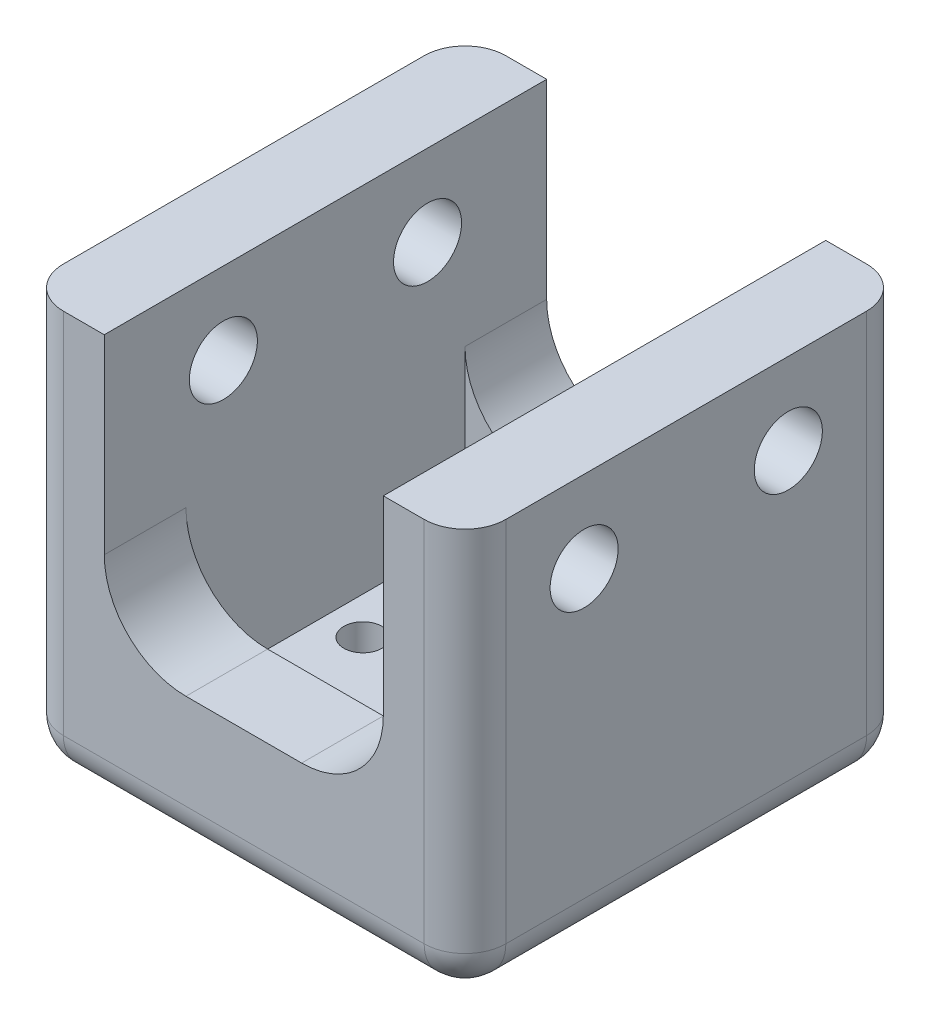
ISO-10303-21;
HEADER;
FILE_DESCRIPTION(('STEP AP214'),'2;1');
FILE_NAME('part.step','',(''),(''),'','','');
FILE_SCHEMA(('AUTOMOTIVE_DESIGN { 1 0 10303 214 1 1 1 1 }'));
ENDSEC;
DATA;
#1=APPLICATION_CONTEXT('core data for automotive mechanical design processes');
#2=APPLICATION_PROTOCOL_DEFINITION('international standard','automotive_design',2000,#1);
#3=PRODUCT_CONTEXT('',#1,'mechanical');
#4=PRODUCT('Part','Part','',(#3));
#5=PRODUCT_RELATED_PRODUCT_CATEGORY('part','',(#4));
#6=PRODUCT_DEFINITION_FORMATION('','',#4);
#7=PRODUCT_DEFINITION_CONTEXT('part definition',#1,'design');
#8=PRODUCT_DEFINITION('design','',#6,#7);
#9=PRODUCT_DEFINITION_SHAPE('','',#8);
#10=(LENGTH_UNIT() NAMED_UNIT(*) SI_UNIT(.MILLI.,.METRE.));
#11=(NAMED_UNIT(*) PLANE_ANGLE_UNIT() SI_UNIT($,.RADIAN.));
#12=(NAMED_UNIT(*) SI_UNIT($,.STERADIAN.) SOLID_ANGLE_UNIT());
#13=UNCERTAINTY_MEASURE_WITH_UNIT(LENGTH_MEASURE(1.E-05),#10,'distance_accuracy_value','');
#14=(GEOMETRIC_REPRESENTATION_CONTEXT(3) GLOBAL_UNCERTAINTY_ASSIGNED_CONTEXT((#13)) GLOBAL_UNIT_ASSIGNED_CONTEXT((#10,
#11,#12)) REPRESENTATION_CONTEXT('',''));
#15=CARTESIAN_POINT('',(0.,0.,0.));
#16=DIRECTION('',(0.,0.,1.));
#17=DIRECTION('',(1.,0.,0.));
#18=AXIS2_PLACEMENT_3D('',#15,#16,#17);
#19=CARTESIAN_POINT('',(0.,38.1,0.));
#20=DIRECTION('',(0.,-1.,0.));
#21=DIRECTION('',(0.,0.,-1.));
#22=AXIS2_PLACEMENT_3D('',#19,#20,#21);
#23=PLANE('',#22);
#24=DIRECTION('',(1.,0.,0.));
#25=VECTOR('',#24,1.);
#26=CARTESIAN_POINT('',(-20.6375,38.1,-20.6375));
#27=LINE('',#26,#25);
#28=CARTESIAN_POINT('',(-16.8275,38.1,-20.6375));
#29=VERTEX_POINT('',#28);
#30=CARTESIAN_POINT('',(-13.0175,38.1,-20.6375));
#31=VERTEX_POINT('',#30);
#32=EDGE_CURVE('E276',#29,#31,#27,.T.);
#33=ORIENTED_EDGE('',*,*,#32,.F.);
#34=CARTESIAN_POINT('',(-16.8275,38.1,-16.8275));
#35=DIRECTION('',(0.,-1.,0.));
#36=DIRECTION('',(0.,0.,-1.));
#37=AXIS2_PLACEMENT_3D('',#34,#35,#36);
#38=CIRCLE('',#37,3.81);
#39=CARTESIAN_POINT('',(-20.6375,38.1,-16.8275));
#40=VERTEX_POINT('',#39);
#41=EDGE_CURVE('E346',#29,#40,#38,.F.);
#42=ORIENTED_EDGE('',*,*,#41,.T.);
#43=DIRECTION('',(0.,0.,-1.));
#44=VECTOR('',#43,1.);
#45=CARTESIAN_POINT('',(-20.6375,38.1,-20.6375));
#46=LINE('',#45,#44);
#47=CARTESIAN_POINT('',(-20.6375,38.1,16.8275));
#48=VERTEX_POINT('',#47);
#49=EDGE_CURVE('E284',#48,#40,#46,.T.);
#50=ORIENTED_EDGE('',*,*,#49,.F.);
#51=CARTESIAN_POINT('',(-16.8275,38.1,16.8275));
#52=DIRECTION('',(0.,-1.,0.));
#53=DIRECTION('',(0.,0.,-1.));
#54=AXIS2_PLACEMENT_3D('',#51,#52,#53);
#55=CIRCLE('',#54,3.81);
#56=CARTESIAN_POINT('',(-16.8275,38.1,20.6375));
#57=VERTEX_POINT('',#56);
#58=EDGE_CURVE('E344',#48,#57,#55,.F.);
#59=ORIENTED_EDGE('',*,*,#58,.T.);
#60=DIRECTION('',(-1.,0.,0.));
#61=VECTOR('',#60,1.);
#62=CARTESIAN_POINT('',(-20.6375,38.1,20.6375));
#63=LINE('',#62,#61);
#64=CARTESIAN_POINT('',(-13.0175,38.1,20.6375));
#65=VERTEX_POINT('',#64);
#66=EDGE_CURVE('E281',#65,#57,#63,.T.);
#67=ORIENTED_EDGE('',*,*,#66,.F.);
#68=DIRECTION('',(0.,0.,-1.));
#69=VECTOR('',#68,1.);
#70=CARTESIAN_POINT('',(-13.0175,38.1,-13.0175));
#71=LINE('',#70,#69);
#72=EDGE_CURVE('E261',#65,#31,#71,.T.);
#73=ORIENTED_EDGE('',*,*,#72,.T.);
#74=EDGE_LOOP('',(#33,#42,#50,#59,#67,#73));
#75=FACE_BOUND('',#74,.T.);
#76=ADVANCED_FACE('F35',(#75),#23,.F.);
#77=CARTESIAN_POINT('',(0.,5.08,0.));
#78=DIRECTION('',(0.,-1.,0.));
#79=DIRECTION('',(0.,0.,-1.));
#80=AXIS2_PLACEMENT_3D('',#77,#78,#79);
#81=PLANE('',#80);
#82=DIRECTION('',(0.,0.,1.));
#83=VECTOR('',#82,1.);
#84=CARTESIAN_POINT('',(-13.0175,5.08,13.0175));
#85=LINE('',#84,#83);
#86=CARTESIAN_POINT('',(-13.0175,5.08,-13.0175));
#87=VERTEX_POINT('',#86);
#88=CARTESIAN_POINT('',(-13.0175,5.08000000000002,13.0175));
#89=VERTEX_POINT('',#88);
#90=EDGE_CURVE('E309',#87,#89,#85,.T.);
#91=ORIENTED_EDGE('',*,*,#90,.T.);
#92=DIRECTION('',(1.,0.,0.));
#93=VECTOR('',#92,1.);
#94=CARTESIAN_POINT('',(-13.0175,5.08,13.0175));
#95=LINE('',#94,#93);
#96=CARTESIAN_POINT('',(13.0175,5.08000000000002,13.0175));
#97=VERTEX_POINT('',#96);
#98=EDGE_CURVE('E314',#89,#97,#95,.T.);
#99=ORIENTED_EDGE('',*,*,#98,.T.);
#100=DIRECTION('',(0.,0.,-1.));
#101=VECTOR('',#100,1.);
#102=CARTESIAN_POINT('',(13.0175,5.08,13.0175));
#103=LINE('',#102,#101);
#104=CARTESIAN_POINT('',(13.0175,5.08000000000002,-13.0175));
#105=VERTEX_POINT('',#104);
#106=EDGE_CURVE('E317',#97,#105,#103,.T.);
#107=ORIENTED_EDGE('',*,*,#106,.T.);
#108=DIRECTION('',(-1.,0.,0.));
#109=VECTOR('',#108,1.);
#110=CARTESIAN_POINT('',(-13.0175,5.08,-13.0175));
#111=LINE('',#110,#109);
#112=EDGE_CURVE('E320',#105,#87,#111,.T.);
#113=ORIENTED_EDGE('',*,*,#112,.T.);
#114=EDGE_LOOP('',(#91,#99,#107,#113));
#115=FACE_BOUND('',#114,.T.);
#116=CARTESIAN_POINT('',(0.,5.08,-9.525));
#117=DIRECTION('',(0.,1.,0.));
#118=DIRECTION('',(0.,0.,1.));
#119=AXIS2_PLACEMENT_3D('',#116,#117,#118);
#120=CIRCLE('',#119,1.778);
#121=CARTESIAN_POINT('',(0.,5.08,-7.747));
#122=VERTEX_POINT('',#121);
#123=EDGE_CURVE('E306',#122,#122,#120,.T.);
#124=ORIENTED_EDGE('',*,*,#123,.F.);
#125=EDGE_LOOP('',(#124));
#126=FACE_BOUND('',#125,.T.);
#127=CARTESIAN_POINT('',(-9.525,5.08,0.));
#128=DIRECTION('',(0.,1.,0.));
#129=DIRECTION('',(0.,0.,1.));
#130=AXIS2_PLACEMENT_3D('',#127,#128,#129);
#131=CIRCLE('',#130,1.778);
#132=CARTESIAN_POINT('',(-9.525,5.08,1.778));
#133=VERTEX_POINT('',#132);
#134=EDGE_CURVE('E300',#133,#133,#131,.T.);
#135=ORIENTED_EDGE('',*,*,#134,.F.);
#136=EDGE_LOOP('',(#135));
#137=FACE_BOUND('',#136,.T.);
#138=CARTESIAN_POINT('',(9.525,5.08,0.));
#139=DIRECTION('',(0.,1.,0.));
#140=DIRECTION('',(0.,0.,1.));
#141=AXIS2_PLACEMENT_3D('',#138,#139,#140);
#142=CIRCLE('',#141,1.778);
#143=CARTESIAN_POINT('',(9.525,5.08,1.778));
#144=VERTEX_POINT('',#143);
#145=EDGE_CURVE('E294',#144,#144,#142,.T.);
#146=ORIENTED_EDGE('',*,*,#145,.F.);
#147=EDGE_LOOP('',(#146));
#148=FACE_BOUND('',#147,.T.);
#149=CARTESIAN_POINT('',(0.,5.08,9.525));
#150=DIRECTION('',(0.,1.,0.));
#151=DIRECTION('',(0.,0.,1.));
#152=AXIS2_PLACEMENT_3D('',#149,#150,#151);
#153=CIRCLE('',#152,1.778);
#154=CARTESIAN_POINT('',(0.,5.08,11.303));
#155=VERTEX_POINT('',#154);
#156=EDGE_CURVE('E288',#155,#155,#153,.T.);
#157=ORIENTED_EDGE('',*,*,#156,.F.);
#158=EDGE_LOOP('',(#157));
#159=FACE_BOUND('',#158,.T.);
#160=ADVANCED_FACE('F442',(#115,#126,#137,#148,#159),#81,.F.);
#161=CARTESIAN_POINT('',(0.,0.,0.));
#162=DIRECTION('',(0.,-1.,0.));
#163=DIRECTION('',(0.,0.,-1.));
#164=AXIS2_PLACEMENT_3D('',#161,#162,#163);
#165=PLANE('',#164);
#166=DIRECTION('',(1.,0.,0.));
#167=VECTOR('',#166,1.);
#168=CARTESIAN_POINT('',(0.,0.,-16.8275));
#169=LINE('',#168,#167);
#170=CARTESIAN_POINT('',(-16.8275,0.,-16.8275));
#171=VERTEX_POINT('',#170);
#172=CARTESIAN_POINT('',(16.8275,0.,-16.8275));
#173=VERTEX_POINT('',#172);
#174=EDGE_CURVE('E355',#171,#173,#169,.T.);
#175=ORIENTED_EDGE('',*,*,#174,.T.);
#176=DIRECTION('',(0.,0.,1.));
#177=VECTOR('',#176,1.);
#178=CARTESIAN_POINT('',(16.8275,0.,0.));
#179=LINE('',#178,#177);
#180=CARTESIAN_POINT('',(16.8275,0.,16.8275));
#181=VERTEX_POINT('',#180);
#182=EDGE_CURVE('E357',#173,#181,#179,.T.);
#183=ORIENTED_EDGE('',*,*,#182,.T.);
#184=DIRECTION('',(-1.,0.,0.));
#185=VECTOR('',#184,1.);
#186=CARTESIAN_POINT('',(0.,0.,16.8275));
#187=LINE('',#186,#185);
#188=CARTESIAN_POINT('',(-16.8275,0.,16.8275));
#189=VERTEX_POINT('',#188);
#190=EDGE_CURVE('E351',#181,#189,#187,.T.);
#191=ORIENTED_EDGE('',*,*,#190,.T.);
#192=DIRECTION('',(0.,0.,-1.));
#193=VECTOR('',#192,1.);
#194=CARTESIAN_POINT('',(-16.8275,0.,0.));
#195=LINE('',#194,#193);
#196=EDGE_CURVE('E353',#189,#171,#195,.T.);
#197=ORIENTED_EDGE('',*,*,#196,.T.);
#198=EDGE_LOOP('',(#175,#183,#191,#197));
#199=FACE_BOUND('',#198,.T.);
#200=CARTESIAN_POINT('',(9.525,0.,0.));
#201=DIRECTION('',(0.,1.,0.));
#202=DIRECTION('',(0.,0.,1.));
#203=AXIS2_PLACEMENT_3D('',#200,#201,#202);
#204=CIRCLE('',#203,1.778);
#205=CARTESIAN_POINT('',(9.525,0.,1.778));
#206=VERTEX_POINT('',#205);
#207=EDGE_CURVE('E291',#206,#206,#204,.T.);
#208=ORIENTED_EDGE('',*,*,#207,.T.);
#209=EDGE_LOOP('',(#208));
#210=FACE_BOUND('',#209,.T.);
#211=CARTESIAN_POINT('',(0.,0.,-9.525));
#212=DIRECTION('',(0.,1.,0.));
#213=DIRECTION('',(0.,0.,1.));
#214=AXIS2_PLACEMENT_3D('',#211,#212,#213);
#215=CIRCLE('',#214,1.778);
#216=CARTESIAN_POINT('',(0.,0.,-7.747));
#217=VERTEX_POINT('',#216);
#218=EDGE_CURVE('E303',#217,#217,#215,.T.);
#219=ORIENTED_EDGE('',*,*,#218,.T.);
#220=EDGE_LOOP('',(#219));
#221=FACE_BOUND('',#220,.T.);
#222=CARTESIAN_POINT('',(-9.525,0.,0.));
#223=DIRECTION('',(0.,1.,0.));
#224=DIRECTION('',(0.,0.,1.));
#225=AXIS2_PLACEMENT_3D('',#222,#223,#224);
#226=CIRCLE('',#225,1.778);
#227=CARTESIAN_POINT('',(-9.525,0.,1.778));
#228=VERTEX_POINT('',#227);
#229=EDGE_CURVE('E297',#228,#228,#226,.T.);
#230=ORIENTED_EDGE('',*,*,#229,.T.);
#231=EDGE_LOOP('',(#230));
#232=FACE_BOUND('',#231,.T.);
#233=CARTESIAN_POINT('',(0.,0.,9.525));
#234=DIRECTION('',(0.,1.,0.));
#235=DIRECTION('',(0.,0.,1.));
#236=AXIS2_PLACEMENT_3D('',#233,#234,#235);
#237=CIRCLE('',#236,1.778);
#238=CARTESIAN_POINT('',(0.,0.,11.303));
#239=VERTEX_POINT('',#238);
#240=EDGE_CURVE('E287',#239,#239,#237,.T.);
#241=ORIENTED_EDGE('',*,*,#240,.T.);
#242=EDGE_LOOP('',(#241));
#243=FACE_BOUND('',#242,.T.);
#244=ADVANCED_FACE('F449',(#199,#210,#221,#232,#243),#165,.T.);
#245=CARTESIAN_POINT('',(0.,5.08,-9.525));
#246=DIRECTION('',(0.,-1.,0.));
#247=DIRECTION('',(0.,0.,-1.));
#248=AXIS2_PLACEMENT_3D('',#245,#246,#247);
#249=CYLINDRICAL_SURFACE('',#248,1.778);
#250=ORIENTED_EDGE('',*,*,#123,.T.);
#251=EDGE_LOOP('',(#250));
#252=FACE_BOUND('',#251,.T.);
#253=ORIENTED_EDGE('',*,*,#218,.F.);
#254=EDGE_LOOP('',(#253));
#255=FACE_BOUND('',#254,.T.);
#256=ADVANCED_FACE('F590',(#252,#255),#249,.F.);
#257=CARTESIAN_POINT('',(-9.525,5.08,0.));
#258=DIRECTION('',(0.,-1.,0.));
#259=DIRECTION('',(0.,0.,-1.));
#260=AXIS2_PLACEMENT_3D('',#257,#258,#259);
#261=CYLINDRICAL_SURFACE('',#260,1.778);
#262=ORIENTED_EDGE('',*,*,#134,.T.);
#263=EDGE_LOOP('',(#262));
#264=FACE_BOUND('',#263,.T.);
#265=ORIENTED_EDGE('',*,*,#229,.F.);
#266=EDGE_LOOP('',(#265));
#267=FACE_BOUND('',#266,.T.);
#268=ADVANCED_FACE('F595',(#264,#267),#261,.F.);
#269=CARTESIAN_POINT('',(9.525,5.08,0.));
#270=DIRECTION('',(0.,-1.,0.));
#271=DIRECTION('',(0.,0.,-1.));
#272=AXIS2_PLACEMENT_3D('',#269,#270,#271);
#273=CYLINDRICAL_SURFACE('',#272,1.778);
#274=ORIENTED_EDGE('',*,*,#145,.T.);
#275=EDGE_LOOP('',(#274));
#276=FACE_BOUND('',#275,.T.);
#277=ORIENTED_EDGE('',*,*,#207,.F.);
#278=EDGE_LOOP('',(#277));
#279=FACE_BOUND('',#278,.T.);
#280=ADVANCED_FACE('F585',(#276,#279),#273,.F.);
#281=CARTESIAN_POINT('',(0.,5.08,9.525));
#282=DIRECTION('',(0.,-1.,0.));
#283=DIRECTION('',(0.,0.,-1.));
#284=AXIS2_PLACEMENT_3D('',#281,#282,#283);
#285=CYLINDRICAL_SURFACE('',#284,1.778);
#286=ORIENTED_EDGE('',*,*,#156,.T.);
#287=EDGE_LOOP('',(#286));
#288=FACE_BOUND('',#287,.T.);
#289=ORIENTED_EDGE('',*,*,#240,.F.);
#290=EDGE_LOOP('',(#289));
#291=FACE_BOUND('',#290,.T.);
#292=ADVANCED_FACE('F582',(#288,#291),#285,.F.);
#293=CARTESIAN_POINT('',(-13.0175,38.1,13.0175));
#294=DIRECTION('',(0.,0.,1.));
#295=DIRECTION('',(1.,0.,0.));
#296=AXIS2_PLACEMENT_3D('',#293,#294,#295);
#297=PLANE('',#296);
#298=DIRECTION('',(0.,-1.,0.));
#299=VECTOR('',#298,1.);
#300=CARTESIAN_POINT('',(-13.0175,38.1,13.0175));
#301=LINE('',#300,#299);
#302=CARTESIAN_POINT('',(-13.0175,20.32,13.0175));
#303=VERTEX_POINT('',#302);
#304=EDGE_CURVE('E268',#303,#89,#301,.T.);
#305=ORIENTED_EDGE('',*,*,#304,.F.);
#306=CARTESIAN_POINT('',(-5.3975,20.32,13.0175));
#307=DIRECTION('',(0.,0.,1.));
#308=DIRECTION('',(1.,0.,0.));
#309=AXIS2_PLACEMENT_3D('',#306,#307,#308);
#310=CIRCLE('',#309,7.62);
#311=CARTESIAN_POINT('',(-5.3975,12.7,13.0175));
#312=VERTEX_POINT('',#311);
#313=EDGE_CURVE('E258',#303,#312,#310,.T.);
#314=ORIENTED_EDGE('',*,*,#313,.T.);
#315=DIRECTION('',(1.,0.,0.));
#316=VECTOR('',#315,1.);
#317=CARTESIAN_POINT('',(-13.0175,12.7,13.0175));
#318=LINE('',#317,#316);
#319=CARTESIAN_POINT('',(5.3975,12.7,13.0175));
#320=VERTEX_POINT('',#319);
#321=EDGE_CURVE('E248',#312,#320,#318,.T.);
#322=ORIENTED_EDGE('',*,*,#321,.T.);
#323=CARTESIAN_POINT('',(5.3975,20.32,13.0175));
#324=DIRECTION('',(0.,0.,1.));
#325=DIRECTION('',(1.,0.,0.));
#326=AXIS2_PLACEMENT_3D('',#323,#324,#325);
#327=CIRCLE('',#326,7.62);
#328=CARTESIAN_POINT('',(13.0175,20.32,13.0175));
#329=VERTEX_POINT('',#328);
#330=EDGE_CURVE('E254',#320,#329,#327,.T.);
#331=ORIENTED_EDGE('',*,*,#330,.T.);
#332=DIRECTION('',(0.,-1.,0.));
#333=VECTOR('',#332,1.);
#334=CARTESIAN_POINT('',(13.0175,38.1,13.0175));
#335=LINE('',#334,#333);
#336=EDGE_CURVE('E271',#329,#97,#335,.T.);
#337=ORIENTED_EDGE('',*,*,#336,.T.);
#338=ORIENTED_EDGE('',*,*,#98,.F.);
#339=EDGE_LOOP('',(#305,#314,#322,#331,#337,#338));
#340=FACE_BOUND('',#339,.T.);
#341=ADVANCED_FACE('F571',(#340),#297,.F.);
#342=CARTESIAN_POINT('',(-13.0175,38.1,-13.0175));
#343=DIRECTION('',(0.,0.,-1.));
#344=DIRECTION('',(-1.,0.,0.));
#345=AXIS2_PLACEMENT_3D('',#342,#343,#344);
#346=PLANE('',#345);
#347=DIRECTION('',(-1.,0.,0.));
#348=VECTOR('',#347,1.);
#349=CARTESIAN_POINT('',(-13.0175,12.7,-13.0175));
#350=LINE('',#349,#348);
#351=CARTESIAN_POINT('',(5.3975,12.7,-13.0175));
#352=VERTEX_POINT('',#351);
#353=CARTESIAN_POINT('',(-5.3975,12.7,-13.0175));
#354=VERTEX_POINT('',#353);
#355=EDGE_CURVE('E240',#352,#354,#350,.T.);
#356=ORIENTED_EDGE('',*,*,#355,.T.);
#357=CARTESIAN_POINT('',(-5.3975,20.32,-13.0175));
#358=DIRECTION('',(0.,0.,-1.));
#359=DIRECTION('',(-1.,0.,0.));
#360=AXIS2_PLACEMENT_3D('',#357,#358,#359);
#361=CIRCLE('',#360,7.62);
#362=CARTESIAN_POINT('',(-13.0175,20.32,-13.0175));
#363=VERTEX_POINT('',#362);
#364=EDGE_CURVE('E193',#354,#363,#361,.T.);
#365=ORIENTED_EDGE('',*,*,#364,.T.);
#366=DIRECTION('',(0.,-1.,0.));
#367=VECTOR('',#366,1.);
#368=CARTESIAN_POINT('',(-13.0175,38.1,-13.0175));
#369=LINE('',#368,#367);
#370=EDGE_CURVE('E267',#363,#87,#369,.T.);
#371=ORIENTED_EDGE('',*,*,#370,.T.);
#372=ORIENTED_EDGE('',*,*,#112,.F.);
#373=DIRECTION('',(0.,-1.,0.));
#374=VECTOR('',#373,1.);
#375=CARTESIAN_POINT('',(13.0175,38.1,-13.0175));
#376=LINE('',#375,#374);
#377=CARTESIAN_POINT('',(13.0175,20.32,-13.0175));
#378=VERTEX_POINT('',#377);
#379=EDGE_CURVE('E273',#378,#105,#376,.T.);
#380=ORIENTED_EDGE('',*,*,#379,.F.);
#381=CARTESIAN_POINT('',(5.3975,20.32,-13.0175));
#382=DIRECTION('',(0.,0.,-1.));
#383=DIRECTION('',(-1.,0.,0.));
#384=AXIS2_PLACEMENT_3D('',#381,#382,#383);
#385=CIRCLE('',#384,7.62);
#386=EDGE_CURVE('E251',#378,#352,#385,.T.);
#387=ORIENTED_EDGE('',*,*,#386,.T.);
#388=EDGE_LOOP('',(#356,#365,#371,#372,#380,#387));
#389=FACE_BOUND('',#388,.T.);
#390=ADVANCED_FACE('F549',(#389),#346,.F.);
#391=CARTESIAN_POINT('',(-13.0175,38.1,-13.0175));
#392=DIRECTION('',(-1.,0.,0.));
#393=DIRECTION('',(0.,0.,1.));
#394=AXIS2_PLACEMENT_3D('',#391,#392,#393);
#395=PLANE('',#394);
#396=CARTESIAN_POINT('',(-13.0175,30.48,-9.525));
#397=DIRECTION('',(-1.,0.,0.));
#398=DIRECTION('',(0.,0.,1.));
#399=AXIS2_PLACEMENT_3D('',#396,#397,#398);
#400=CIRCLE('',#399,3.175);
#401=CARTESIAN_POINT('',(-13.0175,30.48,-6.35));
#402=VERTEX_POINT('',#401);
#403=EDGE_CURVE('E219',#402,#402,#400,.T.);
#404=ORIENTED_EDGE('',*,*,#403,.T.);
#405=EDGE_LOOP('',(#404));
#406=FACE_BOUND('',#405,.T.);
#407=CARTESIAN_POINT('',(-13.0175,30.48,9.525));
#408=DIRECTION('',(-1.,0.,0.));
#409=DIRECTION('',(0.,0.,1.));
#410=AXIS2_PLACEMENT_3D('',#407,#408,#409);
#411=CIRCLE('',#410,3.175);
#412=CARTESIAN_POINT('',(-13.0175,30.48,12.7));
#413=VERTEX_POINT('',#412);
#414=EDGE_CURVE('E409',#413,#413,#411,.T.);
#415=ORIENTED_EDGE('',*,*,#414,.T.);
#416=EDGE_LOOP('',(#415));
#417=FACE_BOUND('',#416,.T.);
#418=ORIENTED_EDGE('',*,*,#370,.F.);
#419=DIRECTION('',(0.,0.,1.));
#420=VECTOR('',#419,1.);
#421=CARTESIAN_POINT('',(-13.0175,20.32,-20.6375));
#422=LINE('',#421,#420);
#423=CARTESIAN_POINT('',(-13.0175,20.32,-20.6375));
#424=VERTEX_POINT('',#423);
#425=EDGE_CURVE('E238',#424,#363,#422,.T.);
#426=ORIENTED_EDGE('',*,*,#425,.F.);
#427=DIRECTION('',(0.,-1.,0.));
#428=VECTOR('',#427,1.);
#429=CARTESIAN_POINT('',(-13.0175,20.32,-20.6375));
#430=LINE('',#429,#428);
#431=EDGE_CURVE('E212',#31,#424,#430,.T.);
#432=ORIENTED_EDGE('',*,*,#431,.F.);
#433=ORIENTED_EDGE('',*,*,#72,.F.);
#434=DIRECTION('',(0.,-1.,0.));
#435=VECTOR('',#434,1.);
#436=CARTESIAN_POINT('',(-13.0175,20.32,20.6375));
#437=LINE('',#436,#435);
#438=CARTESIAN_POINT('',(-13.0175,20.32,20.6375));
#439=VERTEX_POINT('',#438);
#440=EDGE_CURVE('E213',#65,#439,#437,.T.);
#441=ORIENTED_EDGE('',*,*,#440,.T.);
#442=EDGE_CURVE('E241',#303,#439,#422,.T.);
#443=ORIENTED_EDGE('',*,*,#442,.F.);
#444=ORIENTED_EDGE('',*,*,#304,.T.);
#445=ORIENTED_EDGE('',*,*,#90,.F.);
#446=EDGE_LOOP('',(#418,#426,#432,#433,#441,#443,#444,#445));
#447=FACE_BOUND('',#446,.T.);
#448=ADVANCED_FACE('F419',(#406,#417,#447),#395,.F.);
#449=CARTESIAN_POINT('',(13.0175,38.1,-13.0175));
#450=DIRECTION('',(1.,0.,0.));
#451=DIRECTION('',(0.,0.,-1.));
#452=AXIS2_PLACEMENT_3D('',#449,#450,#451);
#453=PLANE('',#452);
#454=CARTESIAN_POINT('',(13.0175,30.48,-9.525));
#455=DIRECTION('',(1.,0.,0.));
#456=DIRECTION('',(0.,0.,-1.));
#457=AXIS2_PLACEMENT_3D('',#454,#455,#456);
#458=CIRCLE('',#457,3.175);
#459=CARTESIAN_POINT('',(13.0175,30.48,-12.7));
#460=VERTEX_POINT('',#459);
#461=EDGE_CURVE('E412',#460,#460,#458,.T.);
#462=ORIENTED_EDGE('',*,*,#461,.T.);
#463=EDGE_LOOP('',(#462));
#464=FACE_BOUND('',#463,.T.);
#465=CARTESIAN_POINT('',(13.0175,30.48,9.525));
#466=DIRECTION('',(1.,0.,0.));
#467=DIRECTION('',(0.,0.,-1.));
#468=AXIS2_PLACEMENT_3D('',#465,#466,#467);
#469=CIRCLE('',#468,3.175);
#470=CARTESIAN_POINT('',(13.0175,30.48,6.35));
#471=VERTEX_POINT('',#470);
#472=EDGE_CURVE('E406',#471,#471,#469,.T.);
#473=ORIENTED_EDGE('',*,*,#472,.T.);
#474=EDGE_LOOP('',(#473));
#475=FACE_BOUND('',#474,.T.);
#476=DIRECTION('',(0.,0.,1.));
#477=VECTOR('',#476,1.);
#478=CARTESIAN_POINT('',(13.0175,38.1,-13.0175));
#479=LINE('',#478,#477);
#480=CARTESIAN_POINT('',(13.0175,38.1,-20.6375));
#481=VERTEX_POINT('',#480);
#482=CARTESIAN_POINT('',(13.0175,38.1,20.6375));
#483=VERTEX_POINT('',#482);
#484=EDGE_CURVE('E264',#481,#483,#479,.T.);
#485=ORIENTED_EDGE('',*,*,#484,.F.);
#486=DIRECTION('',(0.,1.,0.));
#487=VECTOR('',#486,1.);
#488=CARTESIAN_POINT('',(13.0175,38.1,-20.6375));
#489=LINE('',#488,#487);
#490=CARTESIAN_POINT('',(13.0175,20.32,-20.6375));
#491=VERTEX_POINT('',#490);
#492=EDGE_CURVE('E223',#491,#481,#489,.T.);
#493=ORIENTED_EDGE('',*,*,#492,.F.);
#494=DIRECTION('',(0.,0.,1.));
#495=VECTOR('',#494,1.);
#496=CARTESIAN_POINT('',(13.0175,20.32,-20.6375));
#497=LINE('',#496,#495);
#498=EDGE_CURVE('E242',#491,#378,#497,.T.);
#499=ORIENTED_EDGE('',*,*,#498,.T.);
#500=ORIENTED_EDGE('',*,*,#379,.T.);
#501=ORIENTED_EDGE('',*,*,#106,.F.);
#502=ORIENTED_EDGE('',*,*,#336,.F.);
#503=CARTESIAN_POINT('',(13.0175,20.32,20.6375));
#504=VERTEX_POINT('',#503);
#505=EDGE_CURVE('E245',#329,#504,#497,.T.);
#506=ORIENTED_EDGE('',*,*,#505,.T.);
#507=DIRECTION('',(0.,1.,0.));
#508=VECTOR('',#507,1.);
#509=CARTESIAN_POINT('',(13.0175,38.1,20.6375));
#510=LINE('',#509,#508);
#511=EDGE_CURVE('E216',#504,#483,#510,.T.);
#512=ORIENTED_EDGE('',*,*,#511,.T.);
#513=EDGE_LOOP('',(#485,#493,#499,#500,#501,#502,#506,#512));
#514=FACE_BOUND('',#513,.T.);
#515=ADVANCED_FACE('F557',(#464,#475,#514),#453,.F.);
#516=CARTESIAN_POINT('',(-20.6375,38.1,-20.6375));
#517=DIRECTION('',(0.,0.,-1.));
#518=DIRECTION('',(-1.,0.,0.));
#519=AXIS2_PLACEMENT_3D('',#516,#517,#518);
#520=PLANE('',#519);
#521=DIRECTION('',(0.,-1.,0.));
#522=VECTOR('',#521,1.);
#523=CARTESIAN_POINT('',(16.8275,38.1,-20.6375));
#524=LINE('',#523,#522);
#525=CARTESIAN_POINT('',(16.8275,38.1,-20.6375));
#526=VERTEX_POINT('',#525);
#527=CARTESIAN_POINT('',(16.8275,3.81,-20.6375));
#528=VERTEX_POINT('',#527);
#529=EDGE_CURVE('E325',#526,#528,#524,.T.);
#530=ORIENTED_EDGE('',*,*,#529,.T.);
#531=DIRECTION('',(1.,0.,0.));
#532=VECTOR('',#531,1.);
#533=CARTESIAN_POINT('',(-20.6375,3.81,-20.6375));
#534=LINE('',#533,#532);
#535=CARTESIAN_POINT('',(-16.8275,3.81,-20.6375));
#536=VERTEX_POINT('',#535);
#537=EDGE_CURVE('E364',#528,#536,#534,.F.);
#538=ORIENTED_EDGE('',*,*,#537,.T.);
#539=DIRECTION('',(0.,-1.,0.));
#540=VECTOR('',#539,1.);
#541=CARTESIAN_POINT('',(-16.8275,38.1,-20.6375));
#542=LINE('',#541,#540);
#543=EDGE_CURVE('E323',#536,#29,#542,.F.);
#544=ORIENTED_EDGE('',*,*,#543,.T.);
#545=ORIENTED_EDGE('',*,*,#32,.T.);
#546=ORIENTED_EDGE('',*,*,#431,.T.);
#547=CARTESIAN_POINT('',(-5.3975,20.32,-20.6375));
#548=DIRECTION('',(0.,0.,1.));
#549=DIRECTION('',(1.,0.,0.));
#550=AXIS2_PLACEMENT_3D('',#547,#548,#549);
#551=CIRCLE('',#550,7.62);
#552=CARTESIAN_POINT('',(-5.3975,12.7,-20.6375));
#553=VERTEX_POINT('',#552);
#554=EDGE_CURVE('E190',#424,#553,#551,.T.);
#555=ORIENTED_EDGE('',*,*,#554,.T.);
#556=DIRECTION('',(1.,0.,0.));
#557=VECTOR('',#556,1.);
#558=CARTESIAN_POINT('',(5.3975,12.7,-20.6375));
#559=LINE('',#558,#557);
#560=CARTESIAN_POINT('',(5.3975,12.7,-20.6375));
#561=VERTEX_POINT('',#560);
#562=EDGE_CURVE('E200',#553,#561,#559,.T.);
#563=ORIENTED_EDGE('',*,*,#562,.T.);
#564=CARTESIAN_POINT('',(5.3975,20.32,-20.6375));
#565=DIRECTION('',(0.,0.,1.));
#566=DIRECTION('',(-1.,0.,0.));
#567=AXIS2_PLACEMENT_3D('',#564,#565,#566);
#568=CIRCLE('',#567,7.62);
#569=EDGE_CURVE('E207',#561,#491,#568,.T.);
#570=ORIENTED_EDGE('',*,*,#569,.T.);
#571=ORIENTED_EDGE('',*,*,#492,.T.);
#572=EDGE_CURVE('E270',#481,#526,#27,.T.);
#573=ORIENTED_EDGE('',*,*,#572,.T.);
#574=EDGE_LOOP('',(#530,#538,#544,#545,#546,#555,#563,#570,#571,#573));
#575=FACE_BOUND('',#574,.T.);
#576=ADVANCED_FACE('F210',(#575),#520,.T.);
#577=CARTESIAN_POINT('',(-20.6375,38.1,-20.6375));
#578=DIRECTION('',(-1.,0.,0.));
#579=DIRECTION('',(0.,0.,1.));
#580=AXIS2_PLACEMENT_3D('',#577,#578,#579);
#581=PLANE('',#580);
#582=CARTESIAN_POINT('',(-20.6375,30.48,-9.525));
#583=DIRECTION('',(-1.,0.,0.));
#584=DIRECTION('',(0.,0.,1.));
#585=AXIS2_PLACEMENT_3D('',#582,#583,#584);
#586=CIRCLE('',#585,3.175);
#587=CARTESIAN_POINT('',(-20.6375,30.48,-6.35));
#588=VERTEX_POINT('',#587);
#589=EDGE_CURVE('E402',#588,#588,#586,.T.);
#590=ORIENTED_EDGE('',*,*,#589,.F.);
#591=EDGE_LOOP('',(#590));
#592=FACE_BOUND('',#591,.T.);
#593=CARTESIAN_POINT('',(-20.6375,30.48,9.525));
#594=DIRECTION('',(-1.,0.,0.));
#595=DIRECTION('',(0.,0.,1.));
#596=AXIS2_PLACEMENT_3D('',#593,#594,#595);
#597=CIRCLE('',#596,3.175);
#598=CARTESIAN_POINT('',(-20.6375,30.48,12.7));
#599=VERTEX_POINT('',#598);
#600=EDGE_CURVE('E392',#599,#599,#597,.T.);
#601=ORIENTED_EDGE('',*,*,#600,.F.);
#602=EDGE_LOOP('',(#601));
#603=FACE_BOUND('',#602,.T.);
#604=DIRECTION('',(0.,-1.,0.));
#605=VECTOR('',#604,1.);
#606=CARTESIAN_POINT('',(-20.6375,38.1,-16.8275));
#607=LINE('',#606,#605);
#608=CARTESIAN_POINT('',(-20.6375,3.81,-16.8275));
#609=VERTEX_POINT('',#608);
#610=EDGE_CURVE('E342',#40,#609,#607,.T.);
#611=ORIENTED_EDGE('',*,*,#610,.T.);
#612=DIRECTION('',(0.,0.,-1.));
#613=VECTOR('',#612,1.);
#614=CARTESIAN_POINT('',(-20.6375,3.81,-20.6375));
#615=LINE('',#614,#613);
#616=CARTESIAN_POINT('',(-20.6375,3.81,16.8275));
#617=VERTEX_POINT('',#616);
#618=EDGE_CURVE('E59',#609,#617,#615,.F.);
#619=ORIENTED_EDGE('',*,*,#618,.T.);
#620=DIRECTION('',(0.,-1.,0.));
#621=VECTOR('',#620,1.);
#622=CARTESIAN_POINT('',(-20.6375,38.1,16.8275));
#623=LINE('',#622,#621);
#624=EDGE_CURVE('E340',#617,#48,#623,.F.);
#625=ORIENTED_EDGE('',*,*,#624,.T.);
#626=ORIENTED_EDGE('',*,*,#49,.T.);
#627=EDGE_LOOP('',(#611,#619,#625,#626));
#628=FACE_BOUND('',#627,.T.);
#629=ADVANCED_FACE('F540',(#592,#603,#628),#581,.T.);
#630=CARTESIAN_POINT('',(-20.6375,38.1,20.6375));
#631=DIRECTION('',(0.,0.,1.));
#632=DIRECTION('',(1.,0.,0.));
#633=AXIS2_PLACEMENT_3D('',#630,#631,#632);
#634=PLANE('',#633);
#635=DIRECTION('',(0.,-1.,0.));
#636=VECTOR('',#635,1.);
#637=CARTESIAN_POINT('',(-16.8275,38.1,20.6375));
#638=LINE('',#637,#636);
#639=CARTESIAN_POINT('',(-16.8275,3.81,20.6375));
#640=VERTEX_POINT('',#639);
#641=EDGE_CURVE('E336',#57,#640,#638,.T.);
#642=ORIENTED_EDGE('',*,*,#641,.T.);
#643=DIRECTION('',(-1.,0.,0.));
#644=VECTOR('',#643,1.);
#645=CARTESIAN_POINT('',(-20.6375,3.81,20.6375));
#646=LINE('',#645,#644);
#647=CARTESIAN_POINT('',(16.8275,3.81,20.6375));
#648=VERTEX_POINT('',#647);
#649=EDGE_CURVE('E11',#640,#648,#646,.F.);
#650=ORIENTED_EDGE('',*,*,#649,.T.);
#651=DIRECTION('',(0.,-1.,0.));
#652=VECTOR('',#651,1.);
#653=CARTESIAN_POINT('',(16.8275,38.1,20.6375));
#654=LINE('',#653,#652);
#655=CARTESIAN_POINT('',(16.8275,38.1,20.6375));
#656=VERTEX_POINT('',#655);
#657=EDGE_CURVE('E338',#648,#656,#654,.F.);
#658=ORIENTED_EDGE('',*,*,#657,.T.);
#659=EDGE_CURVE('E282',#656,#483,#63,.T.);
#660=ORIENTED_EDGE('',*,*,#659,.T.);
#661=ORIENTED_EDGE('',*,*,#511,.F.);
#662=CARTESIAN_POINT('',(5.3975,20.32,20.6375));
#663=DIRECTION('',(0.,0.,1.));
#664=DIRECTION('',(-1.,0.,0.));
#665=AXIS2_PLACEMENT_3D('',#662,#663,#664);
#666=CIRCLE('',#665,7.62);
#667=CARTESIAN_POINT('',(5.3975,12.7,20.6375));
#668=VERTEX_POINT('',#667);
#669=EDGE_CURVE('E233',#668,#504,#666,.T.);
#670=ORIENTED_EDGE('',*,*,#669,.F.);
#671=DIRECTION('',(1.,0.,0.));
#672=VECTOR('',#671,1.);
#673=CARTESIAN_POINT('',(5.3975,12.7,20.6375));
#674=LINE('',#673,#672);
#675=CARTESIAN_POINT('',(-5.3975,12.7,20.6375));
#676=VERTEX_POINT('',#675);
#677=EDGE_CURVE('E230',#676,#668,#674,.T.);
#678=ORIENTED_EDGE('',*,*,#677,.F.);
#679=CARTESIAN_POINT('',(-5.3975,20.32,20.6375));
#680=DIRECTION('',(0.,0.,1.));
#681=DIRECTION('',(1.,0.,0.));
#682=AXIS2_PLACEMENT_3D('',#679,#680,#681);
#683=CIRCLE('',#682,7.62);
#684=EDGE_CURVE('E227',#439,#676,#683,.T.);
#685=ORIENTED_EDGE('',*,*,#684,.F.);
#686=ORIENTED_EDGE('',*,*,#440,.F.);
#687=ORIENTED_EDGE('',*,*,#66,.T.);
#688=EDGE_LOOP('',(#642,#650,#658,#660,#661,#670,#678,#685,#686,#687));
#689=FACE_BOUND('',#688,.T.);
#690=ADVANCED_FACE('F466',(#689),#634,.T.);
#691=CARTESIAN_POINT('',(20.6375,38.1,-20.6375));
#692=DIRECTION('',(1.,0.,0.));
#693=DIRECTION('',(0.,0.,-1.));
#694=AXIS2_PLACEMENT_3D('',#691,#692,#693);
#695=PLANE('',#694);
#696=CARTESIAN_POINT('',(20.6375,30.48,-9.525));
#697=DIRECTION('',(-1.,0.,0.));
#698=DIRECTION('',(0.,0.,1.));
#699=AXIS2_PLACEMENT_3D('',#696,#697,#698);
#700=CIRCLE('',#699,3.175);
#701=CARTESIAN_POINT('',(20.6375,30.48,-6.35));
#702=VERTEX_POINT('',#701);
#703=EDGE_CURVE('E410',#702,#702,#700,.T.);
#704=ORIENTED_EDGE('',*,*,#703,.T.);
#705=EDGE_LOOP('',(#704));
#706=FACE_BOUND('',#705,.T.);
#707=CARTESIAN_POINT('',(20.6375,30.48,9.525));
#708=DIRECTION('',(-1.,0.,0.));
#709=DIRECTION('',(0.,0.,1.));
#710=AXIS2_PLACEMENT_3D('',#707,#708,#709);
#711=CIRCLE('',#710,3.175);
#712=CARTESIAN_POINT('',(20.6375,30.48,12.7));
#713=VERTEX_POINT('',#712);
#714=EDGE_CURVE('E397',#713,#713,#711,.T.);
#715=ORIENTED_EDGE('',*,*,#714,.T.);
#716=EDGE_LOOP('',(#715));
#717=FACE_BOUND('',#716,.T.);
#718=DIRECTION('',(0.,-1.,0.));
#719=VECTOR('',#718,1.);
#720=CARTESIAN_POINT('',(20.6375,38.1,16.8275));
#721=LINE('',#720,#719);
#722=CARTESIAN_POINT('',(20.6375,38.1,16.8275));
#723=VERTEX_POINT('',#722);
#724=CARTESIAN_POINT('',(20.6375,3.81,16.8275));
#725=VERTEX_POINT('',#724);
#726=EDGE_CURVE('E327',#723,#725,#721,.T.);
#727=ORIENTED_EDGE('',*,*,#726,.T.);
#728=DIRECTION('',(0.,0.,1.));
#729=VECTOR('',#728,1.);
#730=CARTESIAN_POINT('',(20.6375,3.81,-20.6375));
#731=LINE('',#730,#729);
#732=CARTESIAN_POINT('',(20.6375,3.81,-16.8275));
#733=VERTEX_POINT('',#732);
#734=EDGE_CURVE('E360',#725,#733,#731,.F.);
#735=ORIENTED_EDGE('',*,*,#734,.T.);
#736=DIRECTION('',(0.,-1.,0.));
#737=VECTOR('',#736,1.);
#738=CARTESIAN_POINT('',(20.6375,38.1,-16.8275));
#739=LINE('',#738,#737);
#740=CARTESIAN_POINT('',(20.6375,38.1,-16.8275));
#741=VERTEX_POINT('',#740);
#742=EDGE_CURVE('E330',#733,#741,#739,.F.);
#743=ORIENTED_EDGE('',*,*,#742,.T.);
#744=DIRECTION('',(0.,0.,1.));
#745=VECTOR('',#744,1.);
#746=CARTESIAN_POINT('',(20.6375,38.1,-20.6375));
#747=LINE('',#746,#745);
#748=EDGE_CURVE('E278',#741,#723,#747,.T.);
#749=ORIENTED_EDGE('',*,*,#748,.T.);
#750=EDGE_LOOP('',(#727,#735,#743,#749));
#751=FACE_BOUND('',#750,.T.);
#752=ADVANCED_FACE('F457',(#706,#717,#751),#695,.T.);
#753=ORIENTED_EDGE('',*,*,#748,.F.);
#754=CARTESIAN_POINT('',(16.8275,38.1,-16.8275));
#755=DIRECTION('',(0.,-1.,0.));
#756=DIRECTION('',(0.,0.,-1.));
#757=AXIS2_PLACEMENT_3D('',#754,#755,#756);
#758=CIRCLE('',#757,3.81);
#759=EDGE_CURVE('E334',#741,#526,#758,.F.);
#760=ORIENTED_EDGE('',*,*,#759,.T.);
#761=ORIENTED_EDGE('',*,*,#572,.F.);
#762=ORIENTED_EDGE('',*,*,#484,.T.);
#763=ORIENTED_EDGE('',*,*,#659,.F.);
#764=CARTESIAN_POINT('',(16.8275,38.1,16.8275));
#765=DIRECTION('',(0.,-1.,0.));
#766=DIRECTION('',(0.,0.,-1.));
#767=AXIS2_PLACEMENT_3D('',#764,#765,#766);
#768=CIRCLE('',#767,3.81);
#769=EDGE_CURVE('E332',#656,#723,#768,.F.);
#770=ORIENTED_EDGE('',*,*,#769,.T.);
#771=EDGE_LOOP('',(#753,#760,#761,#762,#763,#770));
#772=FACE_BOUND('',#771,.T.);
#773=ADVANCED_FACE('F445',(#772),#23,.F.);
#774=CARTESIAN_POINT('',(5.3975,12.7,-20.6375));
#775=DIRECTION('',(0.,-1.,0.));
#776=DIRECTION('',(0.,0.,-1.));
#777=AXIS2_PLACEMENT_3D('',#774,#775,#776);
#778=PLANE('',#777);
#779=DIRECTION('',(0.,0.,1.));
#780=VECTOR('',#779,1.);
#781=CARTESIAN_POINT('',(-5.3975,12.7,-20.6375));
#782=LINE('',#781,#780);
#783=EDGE_CURVE('E197',#312,#676,#782,.T.);
#784=ORIENTED_EDGE('',*,*,#783,.T.);
#785=ORIENTED_EDGE('',*,*,#677,.T.);
#786=DIRECTION('',(0.,0.,1.));
#787=VECTOR('',#786,1.);
#788=CARTESIAN_POINT('',(5.3975,12.7,-20.6375));
#789=LINE('',#788,#787);
#790=EDGE_CURVE('E196',#320,#668,#789,.T.);
#791=ORIENTED_EDGE('',*,*,#790,.F.);
#792=ORIENTED_EDGE('',*,*,#321,.F.);
#793=EDGE_LOOP('',(#784,#785,#791,#792));
#794=FACE_BOUND('',#793,.T.);
#795=ADVANCED_FACE('F456',(#794),#778,.F.);
#796=CARTESIAN_POINT('',(5.3975,20.32,-20.6375));
#797=DIRECTION('',(0.,0.,1.));
#798=DIRECTION('',(1.,0.,0.));
#799=AXIS2_PLACEMENT_3D('',#796,#797,#798);
#800=CYLINDRICAL_SURFACE('',#799,7.62);
#801=ORIENTED_EDGE('',*,*,#790,.T.);
#802=ORIENTED_EDGE('',*,*,#669,.T.);
#803=ORIENTED_EDGE('',*,*,#505,.F.);
#804=ORIENTED_EDGE('',*,*,#330,.F.);
#805=EDGE_LOOP('',(#801,#802,#803,#804));
#806=FACE_BOUND('',#805,.T.);
#807=ADVANCED_FACE('F463',(#806),#800,.F.);
#808=CARTESIAN_POINT('',(-5.3975,20.32,-20.6375));
#809=DIRECTION('',(0.,0.,1.));
#810=DIRECTION('',(1.,0.,0.));
#811=AXIS2_PLACEMENT_3D('',#808,#809,#810);
#812=CYLINDRICAL_SURFACE('',#811,7.62);
#813=ORIENTED_EDGE('',*,*,#442,.T.);
#814=ORIENTED_EDGE('',*,*,#684,.T.);
#815=ORIENTED_EDGE('',*,*,#783,.F.);
#816=ORIENTED_EDGE('',*,*,#313,.F.);
#817=EDGE_LOOP('',(#813,#814,#815,#816));
#818=FACE_BOUND('',#817,.T.);
#819=ADVANCED_FACE('F566',(#818),#812,.F.);
#820=EDGE_CURVE('E186',#553,#354,#782,.T.);
#821=ORIENTED_EDGE('',*,*,#820,.F.);
#822=ORIENTED_EDGE('',*,*,#554,.F.);
#823=ORIENTED_EDGE('',*,*,#425,.T.);
#824=ORIENTED_EDGE('',*,*,#364,.F.);
#825=EDGE_LOOP('',(#821,#822,#823,#824));
#826=FACE_BOUND('',#825,.T.);
#827=ADVANCED_FACE('F188',(#826),#812,.F.);
#828=ORIENTED_EDGE('',*,*,#498,.F.);
#829=ORIENTED_EDGE('',*,*,#569,.F.);
#830=EDGE_CURVE('E203',#561,#352,#789,.T.);
#831=ORIENTED_EDGE('',*,*,#830,.T.);
#832=ORIENTED_EDGE('',*,*,#386,.F.);
#833=EDGE_LOOP('',(#828,#829,#831,#832));
#834=FACE_BOUND('',#833,.T.);
#835=ADVANCED_FACE('F553',(#834),#800,.F.);
#836=ORIENTED_EDGE('',*,*,#830,.F.);
#837=ORIENTED_EDGE('',*,*,#562,.F.);
#838=ORIENTED_EDGE('',*,*,#820,.T.);
#839=ORIENTED_EDGE('',*,*,#355,.F.);
#840=EDGE_LOOP('',(#836,#837,#838,#839));
#841=FACE_BOUND('',#840,.T.);
#842=ADVANCED_FACE('F201',(#841),#778,.F.);
#843=CARTESIAN_POINT('',(20.6375,30.48,9.525));
#844=DIRECTION('',(-1.,0.,0.));
#845=DIRECTION('',(0.,0.,1.));
#846=AXIS2_PLACEMENT_3D('',#843,#844,#845);
#847=CYLINDRICAL_SURFACE('',#846,3.175);
#848=ORIENTED_EDGE('',*,*,#714,.F.);
#849=EDGE_LOOP('',(#848));
#850=FACE_BOUND('',#849,.T.);
#851=ORIENTED_EDGE('',*,*,#472,.F.);
#852=EDGE_LOOP('',(#851));
#853=FACE_BOUND('',#852,.T.);
#854=ADVANCED_FACE('F437',(#850,#853),#847,.F.);
#855=CARTESIAN_POINT('',(20.6375,30.48,-9.525));
#856=DIRECTION('',(-1.,0.,0.));
#857=DIRECTION('',(0.,0.,1.));
#858=AXIS2_PLACEMENT_3D('',#855,#856,#857);
#859=CYLINDRICAL_SURFACE('',#858,3.175);
#860=ORIENTED_EDGE('',*,*,#703,.F.);
#861=EDGE_LOOP('',(#860));
#862=FACE_BOUND('',#861,.T.);
#863=ORIENTED_EDGE('',*,*,#461,.F.);
#864=EDGE_LOOP('',(#863));
#865=FACE_BOUND('',#864,.T.);
#866=ADVANCED_FACE('F428',(#862,#865),#859,.F.);
#867=ORIENTED_EDGE('',*,*,#600,.T.);
#868=EDGE_LOOP('',(#867));
#869=FACE_BOUND('',#868,.T.);
#870=ORIENTED_EDGE('',*,*,#414,.F.);
#871=EDGE_LOOP('',(#870));
#872=FACE_BOUND('',#871,.T.);
#873=ADVANCED_FACE('F425',(#869,#872),#847,.F.);
#874=ORIENTED_EDGE('',*,*,#589,.T.);
#875=EDGE_LOOP('',(#874));
#876=FACE_BOUND('',#875,.T.);
#877=ORIENTED_EDGE('',*,*,#403,.F.);
#878=EDGE_LOOP('',(#877));
#879=FACE_BOUND('',#878,.T.);
#880=ADVANCED_FACE('F422',(#876,#879),#859,.F.);
#881=CARTESIAN_POINT('',(16.8275,38.1,-16.8275));
#882=DIRECTION('',(0.,-1.,0.));
#883=DIRECTION('',(0.,0.,-1.));
#884=AXIS2_PLACEMENT_3D('',#881,#882,#883);
#885=CYLINDRICAL_SURFACE('',#884,3.81);
#886=ORIENTED_EDGE('',*,*,#742,.F.);
#887=CARTESIAN_POINT('',(16.8275,3.81,-16.8275));
#888=DIRECTION('',(0.,-1.,0.));
#889=DIRECTION('',(0.,0.,-1.));
#890=AXIS2_PLACEMENT_3D('',#887,#888,#889);
#891=CIRCLE('',#890,3.81);
#892=EDGE_CURVE('E362',#733,#528,#891,.F.);
#893=ORIENTED_EDGE('',*,*,#892,.T.);
#894=ORIENTED_EDGE('',*,*,#529,.F.);
#895=ORIENTED_EDGE('',*,*,#759,.F.);
#896=EDGE_LOOP('',(#886,#893,#894,#895));
#897=FACE_BOUND('',#896,.T.);
#898=ADVANCED_FACE('F424',(#897),#885,.T.);
#899=CARTESIAN_POINT('',(16.8275,38.1,16.8275));
#900=DIRECTION('',(0.,-1.,0.));
#901=DIRECTION('',(0.,0.,-1.));
#902=AXIS2_PLACEMENT_3D('',#899,#900,#901);
#903=CYLINDRICAL_SURFACE('',#902,3.81);
#904=ORIENTED_EDGE('',*,*,#657,.F.);
#905=CARTESIAN_POINT('',(16.8275,3.81,16.8275));
#906=DIRECTION('',(0.,-1.,0.));
#907=DIRECTION('',(0.,0.,-1.));
#908=AXIS2_PLACEMENT_3D('',#905,#906,#907);
#909=CIRCLE('',#908,3.81);
#910=EDGE_CURVE('E348',#648,#725,#909,.F.);
#911=ORIENTED_EDGE('',*,*,#910,.T.);
#912=ORIENTED_EDGE('',*,*,#726,.F.);
#913=ORIENTED_EDGE('',*,*,#769,.F.);
#914=EDGE_LOOP('',(#904,#911,#912,#913));
#915=FACE_BOUND('',#914,.T.);
#916=ADVANCED_FACE('F433',(#915),#903,.T.);
#917=CARTESIAN_POINT('',(-16.8275,38.1,-16.8275));
#918=DIRECTION('',(0.,-1.,0.));
#919=DIRECTION('',(0.,0.,-1.));
#920=AXIS2_PLACEMENT_3D('',#917,#918,#919);
#921=CYLINDRICAL_SURFACE('',#920,3.81);
#922=ORIENTED_EDGE('',*,*,#543,.F.);
#923=CARTESIAN_POINT('',(-16.8275,3.81,-16.8275));
#924=DIRECTION('',(0.,-1.,0.));
#925=DIRECTION('',(0.,0.,-1.));
#926=AXIS2_PLACEMENT_3D('',#923,#924,#925);
#927=CIRCLE('',#926,3.81);
#928=EDGE_CURVE('E366',#536,#609,#927,.F.);
#929=ORIENTED_EDGE('',*,*,#928,.T.);
#930=ORIENTED_EDGE('',*,*,#610,.F.);
#931=ORIENTED_EDGE('',*,*,#41,.F.);
#932=EDGE_LOOP('',(#922,#929,#930,#931));
#933=FACE_BOUND('',#932,.T.);
#934=ADVANCED_FACE('F535',(#933),#921,.T.);
#935=CARTESIAN_POINT('',(-16.8275,38.1,16.8275));
#936=DIRECTION('',(0.,-1.,0.));
#937=DIRECTION('',(0.,0.,-1.));
#938=AXIS2_PLACEMENT_3D('',#935,#936,#937);
#939=CYLINDRICAL_SURFACE('',#938,3.81);
#940=ORIENTED_EDGE('',*,*,#624,.F.);
#941=CARTESIAN_POINT('',(-16.8275,3.81,16.8275));
#942=DIRECTION('',(0.,-1.,0.));
#943=DIRECTION('',(0.,0.,-1.));
#944=AXIS2_PLACEMENT_3D('',#941,#942,#943);
#945=CIRCLE('',#944,3.81);
#946=EDGE_CURVE('E44',#617,#640,#945,.F.);
#947=ORIENTED_EDGE('',*,*,#946,.T.);
#948=ORIENTED_EDGE('',*,*,#641,.F.);
#949=ORIENTED_EDGE('',*,*,#58,.F.);
#950=EDGE_LOOP('',(#940,#947,#948,#949));
#951=FACE_BOUND('',#950,.T.);
#952=ADVANCED_FACE('F517',(#951),#939,.T.);
#953=CARTESIAN_POINT('',(-16.8275,3.81,-16.8275));
#954=DIRECTION('',(0.,-1.,0.));
#955=DIRECTION('',(0.,0.,-1.));
#956=AXIS2_PLACEMENT_3D('',#953,#954,#955);
#957=SPHERICAL_SURFACE('',#956,3.81);
#958=CARTESIAN_POINT('',(-16.8275,3.81,-16.8275));
#959=DIRECTION('',(0.,0.,1.));
#960=DIRECTION('',(1.,0.,0.));
#961=AXIS2_PLACEMENT_3D('',#958,#959,#960);
#962=CIRCLE('',#961,3.81);
#963=EDGE_CURVE('E385',#609,#171,#962,.T.);
#964=ORIENTED_EDGE('',*,*,#963,.F.);
#965=ORIENTED_EDGE('',*,*,#928,.F.);
#966=CARTESIAN_POINT('',(-16.8275,3.81,-16.8275));
#967=DIRECTION('',(1.,0.,0.));
#968=DIRECTION('',(0.,0.,-1.));
#969=AXIS2_PLACEMENT_3D('',#966,#967,#968);
#970=CIRCLE('',#969,3.81);
#971=EDGE_CURVE('E39',#171,#536,#970,.T.);
#972=ORIENTED_EDGE('',*,*,#971,.F.);
#973=EDGE_LOOP('',(#964,#965,#972));
#974=FACE_BOUND('',#973,.T.);
#975=ADVANCED_FACE('F37',(#974),#957,.T.);
#976=CARTESIAN_POINT('',(0.,3.81,-16.8275));
#977=DIRECTION('',(1.,0.,0.));
#978=DIRECTION('',(0.,0.,-1.));
#979=AXIS2_PLACEMENT_3D('',#976,#977,#978);
#980=CYLINDRICAL_SURFACE('',#979,3.81);
#981=ORIENTED_EDGE('',*,*,#971,.T.);
#982=ORIENTED_EDGE('',*,*,#537,.F.);
#983=CARTESIAN_POINT('',(16.8275,3.81,-16.8275));
#984=DIRECTION('',(1.,0.,0.));
#985=DIRECTION('',(0.,0.,-1.));
#986=AXIS2_PLACEMENT_3D('',#983,#984,#985);
#987=CIRCLE('',#986,3.81);
#988=EDGE_CURVE('E383',#173,#528,#987,.T.);
#989=ORIENTED_EDGE('',*,*,#988,.F.);
#990=ORIENTED_EDGE('',*,*,#174,.F.);
#991=EDGE_LOOP('',(#981,#982,#989,#990));
#992=FACE_BOUND('',#991,.T.);
#993=ADVANCED_FACE('F482',(#992),#980,.T.);
#994=CARTESIAN_POINT('',(-16.8275,3.81,0.));
#995=DIRECTION('',(0.,0.,-1.));
#996=DIRECTION('',(-1.,0.,0.));
#997=AXIS2_PLACEMENT_3D('',#994,#995,#996);
#998=CYLINDRICAL_SURFACE('',#997,3.81);
#999=ORIENTED_EDGE('',*,*,#963,.T.);
#1000=ORIENTED_EDGE('',*,*,#196,.F.);
#1001=CARTESIAN_POINT('',(-16.8275,3.81,16.8275));
#1002=DIRECTION('',(0.,0.,1.));
#1003=DIRECTION('',(1.,0.,0.));
#1004=AXIS2_PLACEMENT_3D('',#1001,#1002,#1003);
#1005=CIRCLE('',#1004,3.81);
#1006=EDGE_CURVE('E380',#617,#189,#1005,.T.);
#1007=ORIENTED_EDGE('',*,*,#1006,.F.);
#1008=ORIENTED_EDGE('',*,*,#618,.F.);
#1009=EDGE_LOOP('',(#999,#1000,#1007,#1008));
#1010=FACE_BOUND('',#1009,.T.);
#1011=ADVANCED_FACE('F495',(#1010),#998,.T.);
#1012=CARTESIAN_POINT('',(16.8275,3.81,-16.8275));
#1013=DIRECTION('',(0.,-1.,0.));
#1014=DIRECTION('',(0.,0.,-1.));
#1015=AXIS2_PLACEMENT_3D('',#1012,#1013,#1014);
#1016=SPHERICAL_SURFACE('',#1015,3.81);
#1017=ORIENTED_EDGE('',*,*,#988,.T.);
#1018=ORIENTED_EDGE('',*,*,#892,.F.);
#1019=CARTESIAN_POINT('',(16.8275,3.81,-16.8275));
#1020=DIRECTION('',(0.,0.,1.));
#1021=DIRECTION('',(1.,0.,0.));
#1022=AXIS2_PLACEMENT_3D('',#1019,#1020,#1021);
#1023=CIRCLE('',#1022,3.81);
#1024=EDGE_CURVE('E377',#173,#733,#1023,.T.);
#1025=ORIENTED_EDGE('',*,*,#1024,.F.);
#1026=EDGE_LOOP('',(#1017,#1018,#1025));
#1027=FACE_BOUND('',#1026,.T.);
#1028=ADVANCED_FACE('F485',(#1027),#1016,.T.);
#1029=CARTESIAN_POINT('',(-16.8275,3.81,16.8275));
#1030=DIRECTION('',(0.,-1.,0.));
#1031=DIRECTION('',(0.,0.,-1.));
#1032=AXIS2_PLACEMENT_3D('',#1029,#1030,#1031);
#1033=SPHERICAL_SURFACE('',#1032,3.81);
#1034=ORIENTED_EDGE('',*,*,#946,.F.);
#1035=ORIENTED_EDGE('',*,*,#1006,.T.);
#1036=CARTESIAN_POINT('',(-16.8275,3.81,16.8275));
#1037=DIRECTION('',(1.,0.,0.));
#1038=DIRECTION('',(0.,0.,-1.));
#1039=AXIS2_PLACEMENT_3D('',#1036,#1037,#1038);
#1040=CIRCLE('',#1039,3.81);
#1041=EDGE_CURVE('E374',#640,#189,#1040,.T.);
#1042=ORIENTED_EDGE('',*,*,#1041,.F.);
#1043=EDGE_LOOP('',(#1034,#1035,#1042));
#1044=FACE_BOUND('',#1043,.T.);
#1045=ADVANCED_FACE('F498',(#1044),#1033,.T.);
#1046=CARTESIAN_POINT('',(16.8275,3.81,0.));
#1047=DIRECTION('',(0.,0.,1.));
#1048=DIRECTION('',(1.,0.,0.));
#1049=AXIS2_PLACEMENT_3D('',#1046,#1047,#1048);
#1050=CYLINDRICAL_SURFACE('',#1049,3.81);
#1051=ORIENTED_EDGE('',*,*,#1024,.T.);
#1052=ORIENTED_EDGE('',*,*,#734,.F.);
#1053=CARTESIAN_POINT('',(16.8275,3.81,16.8275));
#1054=DIRECTION('',(0.,0.,1.));
#1055=DIRECTION('',(1.,0.,0.));
#1056=AXIS2_PLACEMENT_3D('',#1053,#1054,#1055);
#1057=CIRCLE('',#1056,3.81);
#1058=EDGE_CURVE('E372',#181,#725,#1057,.T.);
#1059=ORIENTED_EDGE('',*,*,#1058,.F.);
#1060=ORIENTED_EDGE('',*,*,#182,.F.);
#1061=EDGE_LOOP('',(#1051,#1052,#1059,#1060));
#1062=FACE_BOUND('',#1061,.T.);
#1063=ADVANCED_FACE('F490',(#1062),#1050,.T.);
#1064=CARTESIAN_POINT('',(0.,3.81,16.8275));
#1065=DIRECTION('',(-1.,0.,0.));
#1066=DIRECTION('',(0.,0.,1.));
#1067=AXIS2_PLACEMENT_3D('',#1064,#1065,#1066);
#1068=CYLINDRICAL_SURFACE('',#1067,3.81);
#1069=ORIENTED_EDGE('',*,*,#1041,.T.);
#1070=ORIENTED_EDGE('',*,*,#190,.F.);
#1071=CARTESIAN_POINT('',(16.8275,3.81,16.8275));
#1072=DIRECTION('',(1.,0.,0.));
#1073=DIRECTION('',(0.,0.,-1.));
#1074=AXIS2_PLACEMENT_3D('',#1071,#1072,#1073);
#1075=CIRCLE('',#1074,3.81);
#1076=EDGE_CURVE('E370',#648,#181,#1075,.T.);
#1077=ORIENTED_EDGE('',*,*,#1076,.F.);
#1078=ORIENTED_EDGE('',*,*,#649,.F.);
#1079=EDGE_LOOP('',(#1069,#1070,#1077,#1078));
#1080=FACE_BOUND('',#1079,.T.);
#1081=ADVANCED_FACE('F501',(#1080),#1068,.T.);
#1082=CARTESIAN_POINT('',(16.8275,3.81,16.8275));
#1083=DIRECTION('',(0.,-1.,0.));
#1084=DIRECTION('',(0.,0.,-1.));
#1085=AXIS2_PLACEMENT_3D('',#1082,#1083,#1084);
#1086=SPHERICAL_SURFACE('',#1085,3.81);
#1087=ORIENTED_EDGE('',*,*,#1058,.T.);
#1088=ORIENTED_EDGE('',*,*,#910,.F.);
#1089=ORIENTED_EDGE('',*,*,#1076,.T.);
#1090=EDGE_LOOP('',(#1087,#1088,#1089));
#1091=FACE_BOUND('',#1090,.T.);
#1092=ADVANCED_FACE('F509',(#1091),#1086,.T.);
#1093=CLOSED_SHELL('',(#76,#160,#244,#256,#268,#280,#292,#341,#390,#448,#515,#576,#629,#690,
#752,#773,#795,#807,#819,#827,#835,#842,#854,#866,#873,#880,#898,#916,#934,#952,#975,#993,#1011,
#1028,#1045,#1063,#1081,#1092));
#1094=MANIFOLD_SOLID_BREP('B2',#1093);
#1095=ADVANCED_BREP_SHAPE_REPRESENTATION('',(#18,#1094),#14);
#1096=SHAPE_DEFINITION_REPRESENTATION(#9,#1095);
ENDSEC;
END-ISO-10303-21;
